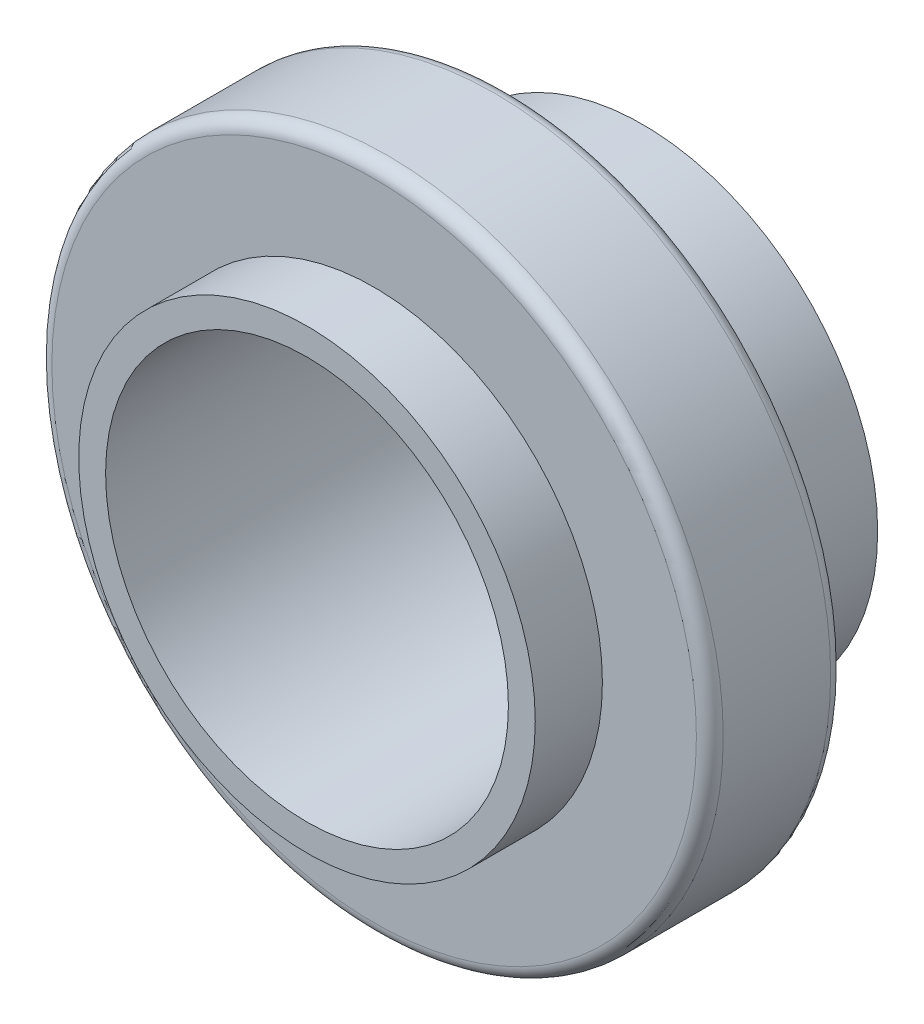
ISO-10303-21;
HEADER;
FILE_DESCRIPTION(('STEP AP214'),'2;1');
FILE_NAME('part.step','',(''),(''),'','','');
FILE_SCHEMA(('AUTOMOTIVE_DESIGN { 1 0 10303 214 1 1 1 1 }'));
ENDSEC;
DATA;
#1=APPLICATION_CONTEXT('core data for automotive mechanical design processes');
#2=APPLICATION_PROTOCOL_DEFINITION('international standard','automotive_design',2000,#1);
#3=PRODUCT_CONTEXT('',#1,'mechanical');
#4=PRODUCT('Part','Part','',(#3));
#5=PRODUCT_RELATED_PRODUCT_CATEGORY('part','',(#4));
#6=PRODUCT_DEFINITION_FORMATION('','',#4);
#7=PRODUCT_DEFINITION_CONTEXT('part definition',#1,'design');
#8=PRODUCT_DEFINITION('design','',#6,#7);
#9=PRODUCT_DEFINITION_SHAPE('','',#8);
#10=(LENGTH_UNIT() NAMED_UNIT(*) SI_UNIT(.MILLI.,.METRE.));
#11=(NAMED_UNIT(*) PLANE_ANGLE_UNIT() SI_UNIT($,.RADIAN.));
#12=(NAMED_UNIT(*) SI_UNIT($,.STERADIAN.) SOLID_ANGLE_UNIT());
#13=UNCERTAINTY_MEASURE_WITH_UNIT(LENGTH_MEASURE(1.E-05),#10,'distance_accuracy_value','');
#14=(GEOMETRIC_REPRESENTATION_CONTEXT(3) GLOBAL_UNCERTAINTY_ASSIGNED_CONTEXT((#13)) GLOBAL_UNIT_ASSIGNED_CONTEXT((#10,
#11,#12)) REPRESENTATION_CONTEXT('',''));
#15=CARTESIAN_POINT('',(0.,0.,0.));
#16=DIRECTION('',(0.,0.,1.));
#17=DIRECTION('',(1.,0.,0.));
#18=AXIS2_PLACEMENT_3D('',#15,#16,#17);
#19=CARTESIAN_POINT('',(0.,0.,10.));
#20=DIRECTION('',(0.,0.,-1.));
#21=DIRECTION('',(-1.,0.,0.));
#22=AXIS2_PLACEMENT_3D('',#19,#20,#21);
#23=CYLINDRICAL_SURFACE('',#22,17.5);
#24=CARTESIAN_POINT('',(0.,0.,10.));
#25=DIRECTION('',(0.,0.,1.));
#26=DIRECTION('',(1.,0.,0.));
#27=AXIS2_PLACEMENT_3D('',#24,#25,#26);
#28=CIRCLE('',#27,17.5);
#29=CARTESIAN_POINT('',(17.5,0.,10.));
#30=VERTEX_POINT('',#29);
#31=EDGE_CURVE('E72',#30,#30,#28,.T.);
#32=ORIENTED_EDGE('',*,*,#31,.F.);
#33=EDGE_LOOP('',(#32));
#34=FACE_BOUND('',#33,.T.);
#35=CARTESIAN_POINT('',(0.,0.,0.));
#36=DIRECTION('',(0.,0.,1.));
#37=DIRECTION('',(1.,0.,0.));
#38=AXIS2_PLACEMENT_3D('',#35,#36,#37);
#39=CIRCLE('',#38,17.5);
#40=CARTESIAN_POINT('',(17.5,0.,0.));
#41=VERTEX_POINT('',#40);
#42=EDGE_CURVE('E68',#41,#41,#39,.T.);
#43=ORIENTED_EDGE('',*,*,#42,.T.);
#44=EDGE_LOOP('',(#43));
#45=FACE_BOUND('',#44,.T.);
#46=ADVANCED_FACE('F37',(#34,#45),#23,.T.);
#47=CARTESIAN_POINT('',(0.,0.,0.));
#48=DIRECTION('',(0.,0.,1.));
#49=DIRECTION('',(1.,0.,0.));
#50=AXIS2_PLACEMENT_3D('',#47,#48,#49);
#51=PLANE('',#50);
#52=CARTESIAN_POINT('',(0.,0.,0.));
#53=DIRECTION('',(0.,0.,1.));
#54=DIRECTION('',(1.,0.,0.));
#55=AXIS2_PLACEMENT_3D('',#52,#53,#54);
#56=CIRCLE('',#55,15.);
#57=CARTESIAN_POINT('',(15.,0.,0.));
#58=VERTEX_POINT('',#57);
#59=EDGE_CURVE('E67',#58,#58,#56,.T.);
#60=ORIENTED_EDGE('',*,*,#59,.T.);
#61=EDGE_LOOP('',(#60));
#62=FACE_BOUND('',#61,.T.);
#63=ORIENTED_EDGE('',*,*,#42,.F.);
#64=EDGE_LOOP('',(#63));
#65=FACE_BOUND('',#64,.T.);
#66=ADVANCED_FACE('F86',(#62,#65),#51,.F.);
#67=CARTESIAN_POINT('',(0.,0.,20.));
#68=DIRECTION('',(0.,0.,-1.));
#69=DIRECTION('',(-1.,0.,0.));
#70=AXIS2_PLACEMENT_3D('',#67,#68,#69);
#71=CYLINDRICAL_SURFACE('',#70,25.);
#72=CARTESIAN_POINT('',(0.,0.,19.));
#73=DIRECTION('',(0.,0.,1.));
#74=DIRECTION('',(1.,0.,0.));
#75=AXIS2_PLACEMENT_3D('',#72,#73,#74);
#76=CIRCLE('',#75,25.);
#77=CARTESIAN_POINT('',(25.,0.,19.));
#78=VERTEX_POINT('',#77);
#79=EDGE_CURVE('E45',#78,#78,#76,.F.);
#80=ORIENTED_EDGE('',*,*,#79,.T.);
#81=EDGE_LOOP('',(#80));
#82=FACE_BOUND('',#81,.T.);
#83=CARTESIAN_POINT('',(0.,0.,11.));
#84=DIRECTION('',(0.,0.,1.));
#85=DIRECTION('',(1.,0.,0.));
#86=AXIS2_PLACEMENT_3D('',#83,#84,#85);
#87=CIRCLE('',#86,25.);
#88=CARTESIAN_POINT('',(25.,0.,11.));
#89=VERTEX_POINT('',#88);
#90=EDGE_CURVE('E50',#89,#89,#87,.T.);
#91=ORIENTED_EDGE('',*,*,#90,.T.);
#92=EDGE_LOOP('',(#91));
#93=FACE_BOUND('',#92,.T.);
#94=ADVANCED_FACE('F109',(#82,#93),#71,.T.);
#95=CARTESIAN_POINT('',(0.,0.,20.));
#96=DIRECTION('',(0.,0.,1.));
#97=DIRECTION('',(1.,0.,0.));
#98=AXIS2_PLACEMENT_3D('',#95,#96,#97);
#99=PLANE('',#98);
#100=CARTESIAN_POINT('',(0.,0.,20.));
#101=DIRECTION('',(0.,0.,1.));
#102=DIRECTION('',(1.,0.,0.));
#103=AXIS2_PLACEMENT_3D('',#100,#101,#102);
#104=CIRCLE('',#103,24.);
#105=CARTESIAN_POINT('',(24.,0.,20.));
#106=VERTEX_POINT('',#105);
#107=EDGE_CURVE('E55',#106,#106,#104,.T.);
#108=ORIENTED_EDGE('',*,*,#107,.T.);
#109=EDGE_LOOP('',(#108));
#110=FACE_BOUND('',#109,.T.);
#111=CARTESIAN_POINT('',(0.,0.,20.));
#112=DIRECTION('',(0.,0.,1.));
#113=DIRECTION('',(1.,0.,0.));
#114=AXIS2_PLACEMENT_3D('',#111,#112,#113);
#115=CIRCLE('',#114,17.);
#116=CARTESIAN_POINT('',(17.,0.,20.));
#117=VERTEX_POINT('',#116);
#118=EDGE_CURVE('E61',#117,#117,#115,.T.);
#119=ORIENTED_EDGE('',*,*,#118,.F.);
#120=EDGE_LOOP('',(#119));
#121=FACE_BOUND('',#120,.T.);
#122=ADVANCED_FACE('F116',(#110,#121),#99,.T.);
#123=CARTESIAN_POINT('',(0.,0.,10.));
#124=DIRECTION('',(0.,0.,1.));
#125=DIRECTION('',(1.,0.,0.));
#126=AXIS2_PLACEMENT_3D('',#123,#124,#125);
#127=PLANE('',#126);
#128=CARTESIAN_POINT('',(0.,0.,10.));
#129=DIRECTION('',(0.,0.,1.));
#130=DIRECTION('',(1.,0.,0.));
#131=AXIS2_PLACEMENT_3D('',#128,#129,#130);
#132=CIRCLE('',#131,24.);
#133=CARTESIAN_POINT('',(24.,0.,10.));
#134=VERTEX_POINT('',#133);
#135=EDGE_CURVE('E10',#134,#134,#132,.F.);
#136=ORIENTED_EDGE('',*,*,#135,.T.);
#137=EDGE_LOOP('',(#136));
#138=FACE_BOUND('',#137,.T.);
#139=ORIENTED_EDGE('',*,*,#31,.T.);
#140=EDGE_LOOP('',(#139));
#141=FACE_BOUND('',#140,.T.);
#142=ADVANCED_FACE('F117',(#138,#141),#127,.F.);
#143=CARTESIAN_POINT('',(0.,0.,25.));
#144=DIRECTION('',(0.,0.,-1.));
#145=DIRECTION('',(-1.,0.,0.));
#146=AXIS2_PLACEMENT_3D('',#143,#144,#145);
#147=CYLINDRICAL_SURFACE('',#146,17.);
#148=CARTESIAN_POINT('',(0.,0.,25.));
#149=DIRECTION('',(0.,0.,1.));
#150=DIRECTION('',(1.,0.,0.));
#151=AXIS2_PLACEMENT_3D('',#148,#149,#150);
#152=CIRCLE('',#151,17.);
#153=CARTESIAN_POINT('',(17.,0.,25.));
#154=VERTEX_POINT('',#153);
#155=EDGE_CURVE('E66',#154,#154,#152,.T.);
#156=ORIENTED_EDGE('',*,*,#155,.F.);
#157=EDGE_LOOP('',(#156));
#158=FACE_BOUND('',#157,.T.);
#159=ORIENTED_EDGE('',*,*,#118,.T.);
#160=EDGE_LOOP('',(#159));
#161=FACE_BOUND('',#160,.T.);
#162=ADVANCED_FACE('F100',(#158,#161),#147,.T.);
#163=CARTESIAN_POINT('',(0.,0.,25.));
#164=DIRECTION('',(0.,0.,1.));
#165=DIRECTION('',(1.,0.,0.));
#166=AXIS2_PLACEMENT_3D('',#163,#164,#165);
#167=PLANE('',#166);
#168=CARTESIAN_POINT('',(0.,0.,25.));
#169=DIRECTION('',(0.,0.,1.));
#170=DIRECTION('',(1.,0.,0.));
#171=AXIS2_PLACEMENT_3D('',#168,#169,#170);
#172=CIRCLE('',#171,15.);
#173=CARTESIAN_POINT('',(15.,0.,25.));
#174=VERTEX_POINT('',#173);
#175=EDGE_CURVE('E62',#174,#174,#172,.T.);
#176=ORIENTED_EDGE('',*,*,#175,.F.);
#177=EDGE_LOOP('',(#176));
#178=FACE_BOUND('',#177,.T.);
#179=ORIENTED_EDGE('',*,*,#155,.T.);
#180=EDGE_LOOP('',(#179));
#181=FACE_BOUND('',#180,.T.);
#182=ADVANCED_FACE('F92',(#178,#181),#167,.T.);
#183=CARTESIAN_POINT('',(0.,0.,0.));
#184=DIRECTION('',(0.,0.,1.));
#185=DIRECTION('',(1.,0.,0.));
#186=AXIS2_PLACEMENT_3D('',#183,#184,#185);
#187=CYLINDRICAL_SURFACE('',#186,15.);
#188=ORIENTED_EDGE('',*,*,#175,.T.);
#189=EDGE_LOOP('',(#188));
#190=FACE_BOUND('',#189,.T.);
#191=ORIENTED_EDGE('',*,*,#59,.F.);
#192=EDGE_LOOP('',(#191));
#193=FACE_BOUND('',#192,.T.);
#194=ADVANCED_FACE('F89',(#190,#193),#187,.F.);
#195=CARTESIAN_POINT('',(0.,0.,19.));
#196=DIRECTION('',(0.,0.,1.));
#197=DIRECTION('',(1.,0.,0.));
#198=AXIS2_PLACEMENT_3D('',#195,#196,#197);
#199=TOROIDAL_SURFACE('',#198,24.,1.);
#200=ORIENTED_EDGE('',*,*,#79,.F.);
#201=EDGE_LOOP('',(#200));
#202=FACE_BOUND('',#201,.T.);
#203=ORIENTED_EDGE('',*,*,#107,.F.);
#204=EDGE_LOOP('',(#203));
#205=FACE_BOUND('',#204,.T.);
#206=ADVANCED_FACE('F91',(#202,#205),#199,.T.);
#207=CARTESIAN_POINT('',(0.,0.,11.));
#208=DIRECTION('',(0.,0.,1.));
#209=DIRECTION('',(1.,0.,0.));
#210=AXIS2_PLACEMENT_3D('',#207,#208,#209);
#211=TOROIDAL_SURFACE('',#210,24.,1.);
#212=ORIENTED_EDGE('',*,*,#135,.F.);
#213=EDGE_LOOP('',(#212));
#214=FACE_BOUND('',#213,.T.);
#215=ORIENTED_EDGE('',*,*,#90,.F.);
#216=EDGE_LOOP('',(#215));
#217=FACE_BOUND('',#216,.T.);
#218=ADVANCED_FACE('F39',(#214,#217),#211,.T.);
#219=CLOSED_SHELL('',(#46,#66,#94,#122,#142,#162,#182,#194,#206,#218));
#220=MANIFOLD_SOLID_BREP('B2',#219);
#221=ADVANCED_BREP_SHAPE_REPRESENTATION('',(#18,#220),#14);
#222=SHAPE_DEFINITION_REPRESENTATION(#9,#221);
ENDSEC;
END-ISO-10303-21;
